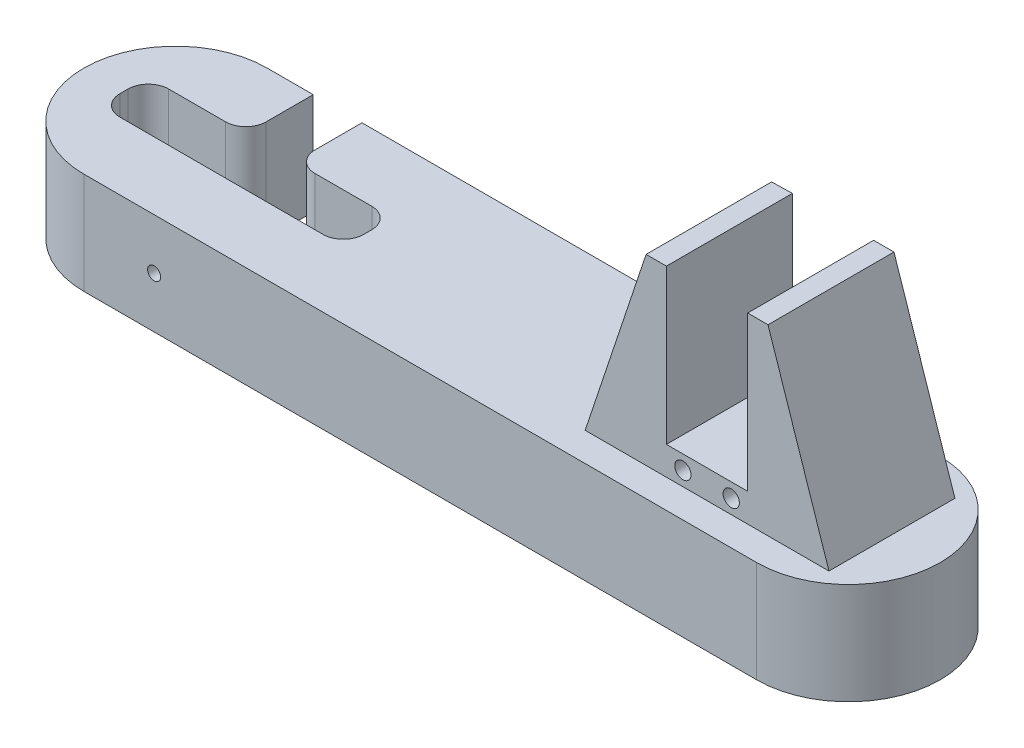
ISO-10303-21;
HEADER;
FILE_DESCRIPTION(('STEP AP214'),'2;1');
FILE_NAME('part.step','',(''),(''),'','','');
FILE_SCHEMA(('AUTOMOTIVE_DESIGN { 1 0 10303 214 1 1 1 1 }'));
ENDSEC;
DATA;
#1=APPLICATION_CONTEXT('core data for automotive mechanical design processes');
#2=APPLICATION_PROTOCOL_DEFINITION('international standard','automotive_design',2000,#1);
#3=PRODUCT_CONTEXT('',#1,'mechanical');
#4=PRODUCT('Part','Part','',(#3));
#5=PRODUCT_RELATED_PRODUCT_CATEGORY('part','',(#4));
#6=PRODUCT_DEFINITION_FORMATION('','',#4);
#7=PRODUCT_DEFINITION_CONTEXT('part definition',#1,'design');
#8=PRODUCT_DEFINITION('design','',#6,#7);
#9=PRODUCT_DEFINITION_SHAPE('','',#8);
#10=(LENGTH_UNIT() NAMED_UNIT(*) SI_UNIT(.MILLI.,.METRE.));
#11=(NAMED_UNIT(*) PLANE_ANGLE_UNIT() SI_UNIT($,.RADIAN.));
#12=(NAMED_UNIT(*) SI_UNIT($,.STERADIAN.) SOLID_ANGLE_UNIT());
#13=UNCERTAINTY_MEASURE_WITH_UNIT(LENGTH_MEASURE(1.E-05),#10,'distance_accuracy_value','');
#14=(GEOMETRIC_REPRESENTATION_CONTEXT(3) GLOBAL_UNCERTAINTY_ASSIGNED_CONTEXT((#13)) GLOBAL_UNIT_ASSIGNED_CONTEXT((#10,
#11,#12)) REPRESENTATION_CONTEXT('',''));
#15=CARTESIAN_POINT('',(0.,0.,0.));
#16=DIRECTION('',(0.,0.,1.));
#17=DIRECTION('',(1.,0.,0.));
#18=AXIS2_PLACEMENT_3D('',#15,#16,#17);
#19=CARTESIAN_POINT('',(-17.3110584301061,-155.276417548068,29.9201970855008));
#20=DIRECTION('',(0.,0.,-1.));
#21=DIRECTION('',(-1.,0.,0.));
#22=AXIS2_PLACEMENT_3D('',#19,#20,#21);
#23=PLANE('',#22);
#24=DIRECTION('',(-1.,0.,0.));
#25=VECTOR('',#24,1.);
#26=CARTESIAN_POINT('',(-17.3110584301061,-130.276417548068,29.9201970855008));
#27=LINE('',#26,#25);
#28=CARTESIAN_POINT('',(-6.,-130.276417548068,29.9201970855008));
#29=VERTEX_POINT('',#28);
#30=CARTESIAN_POINT('',(-17.3110584301061,-130.276417548068,29.9201970855008));
#31=VERTEX_POINT('',#30);
#32=EDGE_CURVE('E267',#29,#31,#27,.T.);
#33=ORIENTED_EDGE('',*,*,#32,.F.);
#34=DIRECTION('',(0.,1.,0.));
#35=VECTOR('',#34,1.);
#36=CARTESIAN_POINT('',(-6.,-155.276417548068,29.9201970855008));
#37=LINE('',#36,#35);
#38=CARTESIAN_POINT('',(-6.,-155.276417548068,29.9201970855008));
#39=VERTEX_POINT('',#38);
#40=EDGE_CURVE('E254',#39,#29,#37,.T.);
#41=ORIENTED_EDGE('',*,*,#40,.F.);
#42=DIRECTION('',(-1.,0.,0.));
#43=VECTOR('',#42,1.);
#44=CARTESIAN_POINT('',(-17.3110584301061,-155.276417548068,29.9201970855008));
#45=LINE('',#44,#43);
#46=CARTESIAN_POINT('',(-17.3110584301061,-155.276417548068,29.9201970855008));
#47=VERTEX_POINT('',#46);
#48=EDGE_CURVE('E265',#39,#47,#45,.T.);
#49=ORIENTED_EDGE('',*,*,#48,.T.);
#50=DIRECTION('',(0.,1.,0.));
#51=VECTOR('',#50,1.);
#52=CARTESIAN_POINT('',(-17.3110584301061,-155.276417548068,29.9201970855008));
#53=LINE('',#52,#51);
#54=EDGE_CURVE('E296',#47,#31,#53,.T.);
#55=ORIENTED_EDGE('',*,*,#54,.T.);
#56=EDGE_LOOP('',(#33,#41,#49,#55));
#57=FACE_BOUND('',#56,.T.);
#58=ADVANCED_FACE('F65',(#57),#23,.T.);
#59=CARTESIAN_POINT('',(148.306843949701,-155.276417548068,29.9201970855008));
#60=VERTEX_POINT('',#59);
#61=CARTESIAN_POINT('',(6.,-155.276417548068,29.9201970855008));
#62=VERTEX_POINT('',#61);
#63=EDGE_CURVE('E275',#60,#62,#45,.T.);
#64=ORIENTED_EDGE('',*,*,#63,.T.);
#65=DIRECTION('',(0.,1.,0.));
#66=VECTOR('',#65,1.);
#67=CARTESIAN_POINT('',(6.,-155.276417548068,29.9201970855008));
#68=LINE('',#67,#66);
#69=CARTESIAN_POINT('',(6.,-130.276417548068,29.9201970855008));
#70=VERTEX_POINT('',#69);
#71=EDGE_CURVE('E269',#62,#70,#68,.T.);
#72=ORIENTED_EDGE('',*,*,#71,.T.);
#73=CARTESIAN_POINT('',(148.306843949701,-130.276417548068,29.9201970855008));
#74=VERTEX_POINT('',#73);
#75=EDGE_CURVE('E293',#74,#70,#27,.T.);
#76=ORIENTED_EDGE('',*,*,#75,.F.);
#77=DIRECTION('',(0.,1.,0.));
#78=VECTOR('',#77,1.);
#79=CARTESIAN_POINT('',(148.306843949701,-155.276417548068,29.9201970855008));
#80=LINE('',#79,#78);
#81=EDGE_CURVE('E299',#60,#74,#80,.T.);
#82=ORIENTED_EDGE('',*,*,#81,.F.);
#83=EDGE_LOOP('',(#64,#72,#76,#82));
#84=FACE_BOUND('',#83,.T.);
#85=ADVANCED_FACE('F515',(#84),#23,.T.);
#86=CARTESIAN_POINT('',(0.,-130.276417548068,0.));
#87=DIRECTION('',(0.,-1.,0.));
#88=DIRECTION('',(0.,0.,-1.));
#89=AXIS2_PLACEMENT_3D('',#86,#87,#88);
#90=PLANE('',#89);
#91=DIRECTION('',(0.,0.,1.));
#92=VECTOR('',#91,1.);
#93=CARTESIAN_POINT('',(114.,-130.276417548068,37.));
#94=LINE('',#93,#92);
#95=CARTESIAN_POINT('',(114.,-130.276417548068,37.));
#96=VERTEX_POINT('',#95);
#97=CARTESIAN_POINT('',(114.,-130.276417548068,37.1297250662334));
#98=VERTEX_POINT('',#97);
#99=EDGE_CURVE('E338',#96,#98,#94,.T.);
#100=ORIENTED_EDGE('',*,*,#99,.T.);
#101=DIRECTION('',(0.999663597969475,0.,-0.0259362852915358));
#102=VECTOR('',#101,1.);
#103=CARTESIAN_POINT('',(114.,-130.276417548068,37.1297250662334));
#104=LINE('',#103,#102);
#105=CARTESIAN_POINT('',(119.,-130.276417548068,37.));
#106=VERTEX_POINT('',#105);
#107=EDGE_CURVE('E365',#98,#106,#104,.T.);
#108=ORIENTED_EDGE('',*,*,#107,.T.);
#109=DIRECTION('',(1.,0.,0.));
#110=VECTOR('',#109,1.);
#111=CARTESIAN_POINT('',(0.,-130.276417548068,37.));
#112=LINE('',#111,#110);
#113=CARTESIAN_POINT('',(159.,-130.276417548068,37.));
#114=VERTEX_POINT('',#113);
#115=EDGE_CURVE('E392',#106,#114,#112,.T.);
#116=ORIENTED_EDGE('',*,*,#115,.T.);
#117=DIRECTION('',(0.,0.,1.));
#118=VECTOR('',#117,1.);
#119=CARTESIAN_POINT('',(159.,-130.276417548068,37.));
#120=LINE('',#119,#118);
#121=CARTESIAN_POINT('',(159.,-130.276417548068,68.));
#122=VERTEX_POINT('',#121);
#123=EDGE_CURVE('E345',#114,#122,#120,.T.);
#124=ORIENTED_EDGE('',*,*,#123,.T.);
#125=DIRECTION('',(1.,0.,0.));
#126=VECTOR('',#125,1.);
#127=CARTESIAN_POINT('',(0.,-130.276417548068,68.));
#128=LINE('',#127,#126);
#129=CARTESIAN_POINT('',(99.,-130.276417548068,68.));
#130=VERTEX_POINT('',#129);
#131=EDGE_CURVE('E383',#130,#122,#128,.T.);
#132=ORIENTED_EDGE('',*,*,#131,.F.);
#133=DIRECTION('',(0.,0.,1.));
#134=VECTOR('',#133,1.);
#135=CARTESIAN_POINT('',(99.,-130.276417548068,37.));
#136=LINE('',#135,#134);
#137=CARTESIAN_POINT('',(99.,-130.276417548068,37.));
#138=VERTEX_POINT('',#137);
#139=EDGE_CURVE('E331',#138,#130,#136,.T.);
#140=ORIENTED_EDGE('',*,*,#139,.F.);
#141=DIRECTION('',(1.,0.,0.));
#142=VECTOR('',#141,1.);
#143=CARTESIAN_POINT('',(0.,-130.276417548068,37.));
#144=LINE('',#143,#142);
#145=EDGE_CURVE('E326',#138,#96,#144,.T.);
#146=ORIENTED_EDGE('',*,*,#145,.T.);
#147=EDGE_LOOP('',(#100,#108,#116,#124,#132,#140,#146));
#148=FACE_BOUND('',#147,.T.);
#149=DIRECTION('',(1.,0.,0.));
#150=VECTOR('',#149,1.);
#151=CARTESIAN_POINT('',(0.,-130.276417548068,46.5));
#152=LINE('',#151,#150);
#153=CARTESIAN_POINT('',(-25.,-130.276417548068,46.5));
#154=VERTEX_POINT('',#153);
#155=CARTESIAN_POINT('',(-11.,-130.276417548068,46.5));
#156=VERTEX_POINT('',#155);
#157=EDGE_CURVE('E476',#154,#156,#152,.T.);
#158=ORIENTED_EDGE('',*,*,#157,.T.);
#159=CARTESIAN_POINT('',(-11.,-130.276417548068,41.5));
#160=DIRECTION('',(0.,-1.,0.));
#161=DIRECTION('',(0.,0.,-1.));
#162=AXIS2_PLACEMENT_3D('',#159,#160,#161);
#163=CIRCLE('',#162,5.);
#164=CARTESIAN_POINT('',(-6.,-130.276417548068,41.5));
#165=VERTEX_POINT('',#164);
#166=EDGE_CURVE('E423',#156,#165,#163,.F.);
#167=ORIENTED_EDGE('',*,*,#166,.T.);
#168=DIRECTION('',(0.,0.,-1.));
#169=VECTOR('',#168,1.);
#170=CARTESIAN_POINT('',(-6.,-130.276417548068,0.));
#171=LINE('',#170,#169);
#172=EDGE_CURVE('E308',#165,#29,#171,.T.);
#173=ORIENTED_EDGE('',*,*,#172,.T.);
#174=ORIENTED_EDGE('',*,*,#32,.T.);
#175=CARTESIAN_POINT('',(-17.3110584301061,-130.276417548068,52.5));
#176=DIRECTION('',(0.,1.,0.));
#177=DIRECTION('',(0.,0.,1.));
#178=AXIS2_PLACEMENT_3D('',#175,#176,#177);
#179=CIRCLE('',#178,22.5798029144992);
#180=CARTESIAN_POINT('',(-17.3110584301061,-130.276417548068,75.0798029144992));
#181=VERTEX_POINT('',#180);
#182=EDGE_CURVE('E268',#31,#181,#179,.T.);
#183=ORIENTED_EDGE('',*,*,#182,.T.);
#184=DIRECTION('',(1.,0.,0.));
#185=VECTOR('',#184,1.);
#186=CARTESIAN_POINT('',(-17.3110584301061,-130.276417548068,75.0798029144992));
#187=LINE('',#186,#185);
#188=CARTESIAN_POINT('',(148.306843949701,-130.276417548068,75.0798029144992));
#189=VERTEX_POINT('',#188);
#190=EDGE_CURVE('E287',#181,#189,#187,.T.);
#191=ORIENTED_EDGE('',*,*,#190,.T.);
#192=CARTESIAN_POINT('',(148.306843949701,-130.276417548068,52.5));
#193=DIRECTION('',(0.,1.,0.));
#194=DIRECTION('',(0.,0.,1.));
#195=AXIS2_PLACEMENT_3D('',#192,#193,#194);
#196=CIRCLE('',#195,22.5798029144992);
#197=EDGE_CURVE('E290',#189,#74,#196,.T.);
#198=ORIENTED_EDGE('',*,*,#197,.T.);
#199=ORIENTED_EDGE('',*,*,#75,.T.);
#200=DIRECTION('',(0.,0.,-1.));
#201=VECTOR('',#200,1.);
#202=CARTESIAN_POINT('',(6.,-130.276417548068,0.));
#203=LINE('',#202,#201);
#204=CARTESIAN_POINT('',(6.,-130.276417548068,41.5));
#205=VERTEX_POINT('',#204);
#206=EDGE_CURVE('E306',#205,#70,#203,.T.);
#207=ORIENTED_EDGE('',*,*,#206,.F.);
#208=CARTESIAN_POINT('',(11.,-130.276417548068,41.5));
#209=DIRECTION('',(0.,-1.,0.));
#210=DIRECTION('',(0.,0.,-1.));
#211=AXIS2_PLACEMENT_3D('',#208,#209,#210);
#212=CIRCLE('',#211,5.);
#213=CARTESIAN_POINT('',(11.,-130.276417548068,46.5));
#214=VERTEX_POINT('',#213);
#215=EDGE_CURVE('E421',#205,#214,#212,.F.);
#216=ORIENTED_EDGE('',*,*,#215,.T.);
#217=DIRECTION('',(1.,0.,0.));
#218=VECTOR('',#217,1.);
#219=CARTESIAN_POINT('',(0.,-130.276417548068,46.5));
#220=LINE('',#219,#218);
#221=CARTESIAN_POINT('',(25.,-130.276417548068,46.5));
#222=VERTEX_POINT('',#221);
#223=EDGE_CURVE('E461',#214,#222,#220,.T.);
#224=ORIENTED_EDGE('',*,*,#223,.T.);
#225=CARTESIAN_POINT('',(25.,-130.276417548068,51.5));
#226=DIRECTION('',(0.,-1.,0.));
#227=DIRECTION('',(0.,0.,-1.));
#228=AXIS2_PLACEMENT_3D('',#225,#226,#227);
#229=CIRCLE('',#228,5.);
#230=CARTESIAN_POINT('',(30.,-130.276417548068,51.5));
#231=VERTEX_POINT('',#230);
#232=EDGE_CURVE('E73',#222,#231,#229,.T.);
#233=ORIENTED_EDGE('',*,*,#232,.T.);
#234=DIRECTION('',(0.,0.,1.));
#235=VECTOR('',#234,1.);
#236=CARTESIAN_POINT('',(30.,-130.276417548068,0.));
#237=LINE('',#236,#235);
#238=CARTESIAN_POINT('',(30.,-130.276417548068,53.5));
#239=VERTEX_POINT('',#238);
#240=EDGE_CURVE('E459',#231,#239,#237,.T.);
#241=ORIENTED_EDGE('',*,*,#240,.T.);
#242=CARTESIAN_POINT('',(25.,-130.276417548068,53.5));
#243=DIRECTION('',(0.,-1.,0.));
#244=DIRECTION('',(0.,0.,-1.));
#245=AXIS2_PLACEMENT_3D('',#242,#243,#244);
#246=CIRCLE('',#245,5.);
#247=CARTESIAN_POINT('',(25.,-130.276417548068,58.5));
#248=VERTEX_POINT('',#247);
#249=EDGE_CURVE('E410',#239,#248,#246,.T.);
#250=ORIENTED_EDGE('',*,*,#249,.T.);
#251=DIRECTION('',(1.,0.,0.));
#252=VECTOR('',#251,1.);
#253=CARTESIAN_POINT('',(0.,-130.276417548068,58.5));
#254=LINE('',#253,#252);
#255=CARTESIAN_POINT('',(-25.,-130.276417548068,58.5));
#256=VERTEX_POINT('',#255);
#257=EDGE_CURVE('E298',#256,#248,#254,.T.);
#258=ORIENTED_EDGE('',*,*,#257,.F.);
#259=CARTESIAN_POINT('',(-25.,-130.276417548068,53.5));
#260=DIRECTION('',(0.,-1.,0.));
#261=DIRECTION('',(0.,0.,-1.));
#262=AXIS2_PLACEMENT_3D('',#259,#260,#261);
#263=CIRCLE('',#262,5.);
#264=CARTESIAN_POINT('',(-30.,-130.276417548068,53.5));
#265=VERTEX_POINT('',#264);
#266=EDGE_CURVE('E447',#256,#265,#263,.T.);
#267=ORIENTED_EDGE('',*,*,#266,.T.);
#268=DIRECTION('',(0.,0.,-1.));
#269=VECTOR('',#268,1.);
#270=CARTESIAN_POINT('',(-30.,-130.276417548068,0.));
#271=LINE('',#270,#269);
#272=CARTESIAN_POINT('',(-30.,-130.276417548068,51.5));
#273=VERTEX_POINT('',#272);
#274=EDGE_CURVE('E468',#265,#273,#271,.T.);
#275=ORIENTED_EDGE('',*,*,#274,.T.);
#276=CARTESIAN_POINT('',(-25.,-130.276417548068,51.5));
#277=DIRECTION('',(0.,-1.,0.));
#278=DIRECTION('',(0.,0.,-1.));
#279=AXIS2_PLACEMENT_3D('',#276,#277,#278);
#280=CIRCLE('',#279,5.);
#281=EDGE_CURVE('E451',#273,#154,#280,.T.);
#282=ORIENTED_EDGE('',*,*,#281,.T.);
#283=EDGE_LOOP('',(#158,#167,#173,#174,#183,#191,#198,#199,#207,#216,#224,#233,#241,#250,#258,
#267,#275,#282));
#284=FACE_BOUND('',#283,.T.);
#285=ADVANCED_FACE('F458',(#148,#284),#90,.F.);
#286=CARTESIAN_POINT('',(0.,-123.276417548068,68.));
#287=DIRECTION('',(0.,0.,-1.));
#288=DIRECTION('',(-1.,0.,0.));
#289=AXIS2_PLACEMENT_3D('',#286,#287,#288);
#290=PLANE('',#289);
#291=CARTESIAN_POINT('',(134.95,-126.776417548068,68.));
#292=DIRECTION('',(0.,0.,-1.));
#293=DIRECTION('',(-1.,0.,0.));
#294=AXIS2_PLACEMENT_3D('',#291,#292,#293);
#295=CIRCLE('',#294,2.);
#296=CARTESIAN_POINT('',(132.95,-126.776417548068,68.));
#297=VERTEX_POINT('',#296);
#298=EDGE_CURVE('E319',#297,#297,#295,.T.);
#299=ORIENTED_EDGE('',*,*,#298,.T.);
#300=EDGE_LOOP('',(#299));
#301=FACE_BOUND('',#300,.T.);
#302=CARTESIAN_POINT('',(123.05,-126.776417548068,68.));
#303=DIRECTION('',(0.,0.,-1.));
#304=DIRECTION('',(-1.,0.,0.));
#305=AXIS2_PLACEMENT_3D('',#302,#303,#304);
#306=CIRCLE('',#305,2.);
#307=CARTESIAN_POINT('',(121.05,-126.776417548068,68.));
#308=VERTEX_POINT('',#307);
#309=EDGE_CURVE('E314',#308,#308,#306,.T.);
#310=ORIENTED_EDGE('',*,*,#309,.T.);
#311=EDGE_LOOP('',(#310));
#312=FACE_BOUND('',#311,.T.);
#313=ORIENTED_EDGE('',*,*,#131,.T.);
#314=DIRECTION('',(0.316227766016838,-0.948683298050514,0.));
#315=VECTOR('',#314,1.);
#316=CARTESIAN_POINT('',(104.01707473558,34.6723582451933,68.));
#317=LINE('',#316,#315);
#318=CARTESIAN_POINT('',(144.,-85.2764175480678,68.));
#319=VERTEX_POINT('',#318);
#320=EDGE_CURVE('E337',#319,#122,#317,.T.);
#321=ORIENTED_EDGE('',*,*,#320,.F.);
#322=DIRECTION('',(1.,0.,0.));
#323=VECTOR('',#322,1.);
#324=CARTESIAN_POINT('',(139.,-85.2764175480678,68.));
#325=LINE('',#324,#323);
#326=CARTESIAN_POINT('',(139.,-85.2764175480678,68.));
#327=VERTEX_POINT('',#326);
#328=EDGE_CURVE('E355',#327,#319,#325,.T.);
#329=ORIENTED_EDGE('',*,*,#328,.F.);
#330=DIRECTION('',(0.,-1.,0.));
#331=VECTOR('',#330,1.);
#332=CARTESIAN_POINT('',(139.,-85.2764175480678,68.));
#333=LINE('',#332,#331);
#334=CARTESIAN_POINT('',(139.,-123.276417548068,68.));
#335=VERTEX_POINT('',#334);
#336=EDGE_CURVE('E352',#327,#335,#333,.T.);
#337=ORIENTED_EDGE('',*,*,#336,.T.);
#338=DIRECTION('',(1.,0.,0.));
#339=VECTOR('',#338,1.);
#340=CARTESIAN_POINT('',(0.,-123.276417548068,68.));
#341=LINE('',#340,#339);
#342=CARTESIAN_POINT('',(119.,-123.276417548068,68.));
#343=VERTEX_POINT('',#342);
#344=EDGE_CURVE('E388',#343,#335,#341,.T.);
#345=ORIENTED_EDGE('',*,*,#344,.F.);
#346=DIRECTION('',(0.,-1.,0.));
#347=VECTOR('',#346,1.);
#348=CARTESIAN_POINT('',(119.,-85.2764175480678,68.));
#349=LINE('',#348,#347);
#350=CARTESIAN_POINT('',(119.,-85.2764175480678,68.));
#351=VERTEX_POINT('',#350);
#352=EDGE_CURVE('E384',#351,#343,#349,.T.);
#353=ORIENTED_EDGE('',*,*,#352,.F.);
#354=DIRECTION('',(-1.,0.,0.));
#355=VECTOR('',#354,1.);
#356=CARTESIAN_POINT('',(119.,-85.2764175480678,68.));
#357=LINE('',#356,#355);
#358=CARTESIAN_POINT('',(114.,-85.2764175480678,68.));
#359=VERTEX_POINT('',#358);
#360=EDGE_CURVE('E372',#351,#359,#357,.T.);
#361=ORIENTED_EDGE('',*,*,#360,.T.);
#362=DIRECTION('',(-0.316227766016838,-0.948683298050514,0.));
#363=VECTOR('',#362,1.);
#364=CARTESIAN_POINT('',(128.18292526442,-42.7276417548068,68.));
#365=LINE('',#364,#363);
#366=EDGE_CURVE('E322',#359,#130,#365,.T.);
#367=ORIENTED_EDGE('',*,*,#366,.T.);
#368=EDGE_LOOP('',(#313,#321,#329,#337,#345,#353,#361,#367));
#369=FACE_BOUND('',#368,.T.);
#370=ADVANCED_FACE('F708',(#301,#312,#369),#290,.F.);
#371=CARTESIAN_POINT('',(0.,-123.276417548068,37.));
#372=DIRECTION('',(0.,0.,-1.));
#373=DIRECTION('',(-1.,0.,0.));
#374=AXIS2_PLACEMENT_3D('',#371,#372,#373);
#375=PLANE('',#374);
#376=CARTESIAN_POINT('',(134.95,-126.776417548068,37.));
#377=DIRECTION('',(0.,0.,-1.));
#378=DIRECTION('',(-1.,0.,0.));
#379=AXIS2_PLACEMENT_3D('',#376,#377,#378);
#380=CIRCLE('',#379,2.);
#381=CARTESIAN_POINT('',(132.95,-126.776417548068,37.));
#382=VERTEX_POINT('',#381);
#383=EDGE_CURVE('E311',#382,#382,#380,.T.);
#384=ORIENTED_EDGE('',*,*,#383,.F.);
#385=EDGE_LOOP('',(#384));
#386=FACE_BOUND('',#385,.T.);
#387=CARTESIAN_POINT('',(123.05,-126.776417548068,37.));
#388=DIRECTION('',(0.,0.,-1.));
#389=DIRECTION('',(-1.,0.,0.));
#390=AXIS2_PLACEMENT_3D('',#387,#388,#389);
#391=CIRCLE('',#390,2.);
#392=CARTESIAN_POINT('',(121.05,-126.776417548068,37.));
#393=VERTEX_POINT('',#392);
#394=EDGE_CURVE('E310',#393,#393,#391,.T.);
#395=ORIENTED_EDGE('',*,*,#394,.F.);
#396=EDGE_LOOP('',(#395));
#397=FACE_BOUND('',#396,.T.);
#398=ORIENTED_EDGE('',*,*,#115,.F.);
#399=DIRECTION('',(0.,-1.,0.));
#400=VECTOR('',#399,1.);
#401=CARTESIAN_POINT('',(119.,-123.276417548068,37.));
#402=LINE('',#401,#400);
#403=CARTESIAN_POINT('',(119.,-123.276417548068,37.));
#404=VERTEX_POINT('',#403);
#405=EDGE_CURVE('E401',#404,#106,#402,.T.);
#406=ORIENTED_EDGE('',*,*,#405,.F.);
#407=DIRECTION('',(1.,0.,0.));
#408=VECTOR('',#407,1.);
#409=CARTESIAN_POINT('',(0.,-123.276417548068,37.));
#410=LINE('',#409,#408);
#411=CARTESIAN_POINT('',(139.,-123.276417548068,37.));
#412=VERTEX_POINT('',#411);
#413=EDGE_CURVE('E395',#404,#412,#410,.T.);
#414=ORIENTED_EDGE('',*,*,#413,.T.);
#415=DIRECTION('',(0.,-1.,0.));
#416=VECTOR('',#415,1.);
#417=CARTESIAN_POINT('',(139.,-85.2764175480678,37.));
#418=LINE('',#417,#416);
#419=CARTESIAN_POINT('',(139.,-85.2764175480678,37.));
#420=VERTEX_POINT('',#419);
#421=EDGE_CURVE('E350',#420,#412,#418,.T.);
#422=ORIENTED_EDGE('',*,*,#421,.F.);
#423=DIRECTION('',(-1.,0.,0.));
#424=VECTOR('',#423,1.);
#425=CARTESIAN_POINT('',(144.,-85.2764175480678,37.));
#426=LINE('',#425,#424);
#427=CARTESIAN_POINT('',(144.,-85.2764175480678,37.));
#428=VERTEX_POINT('',#427);
#429=EDGE_CURVE('E360',#428,#420,#426,.T.);
#430=ORIENTED_EDGE('',*,*,#429,.F.);
#431=DIRECTION('',(0.316227766016838,-0.948683298050514,0.));
#432=VECTOR('',#431,1.);
#433=CARTESIAN_POINT('',(104.01707473558,34.6723582451933,37.));
#434=LINE('',#433,#432);
#435=EDGE_CURVE('E342',#428,#114,#434,.T.);
#436=ORIENTED_EDGE('',*,*,#435,.T.);
#437=EDGE_LOOP('',(#398,#406,#414,#422,#430,#436));
#438=FACE_BOUND('',#437,.T.);
#439=ADVANCED_FACE('F798',(#386,#397,#438),#375,.T.);
#440=CARTESIAN_POINT('',(0.,-123.276417548068,0.));
#441=DIRECTION('',(0.,1.,0.));
#442=DIRECTION('',(0.,0.,1.));
#443=AXIS2_PLACEMENT_3D('',#440,#441,#442);
#444=PLANE('',#443);
#445=ORIENTED_EDGE('',*,*,#344,.T.);
#446=DIRECTION('',(0.,0.,-1.));
#447=VECTOR('',#446,1.);
#448=CARTESIAN_POINT('',(139.,-123.276417548068,0.));
#449=LINE('',#448,#447);
#450=EDGE_CURVE('E391',#335,#412,#449,.T.);
#451=ORIENTED_EDGE('',*,*,#450,.T.);
#452=ORIENTED_EDGE('',*,*,#413,.F.);
#453=DIRECTION('',(0.,0.,1.));
#454=VECTOR('',#453,1.);
#455=CARTESIAN_POINT('',(119.,-123.276417548068,0.));
#456=LINE('',#455,#454);
#457=EDGE_CURVE('E398',#404,#343,#456,.T.);
#458=ORIENTED_EDGE('',*,*,#457,.T.);
#459=EDGE_LOOP('',(#445,#451,#452,#458));
#460=FACE_BOUND('',#459,.T.);
#461=ADVANCED_FACE('F803',(#460),#444,.T.);
#462=CARTESIAN_POINT('',(114.,-85.2764175480678,37.1297250662334));
#463=DIRECTION('',(-0.0259362852915358,0.,-0.999663597969475));
#464=DIRECTION('',(-0.999663597969475,0.,0.0259362852915358));
#465=AXIS2_PLACEMENT_3D('',#462,#463,#464);
#466=PLANE('',#465);
#467=ORIENTED_EDGE('',*,*,#107,.F.);
#468=DIRECTION('',(0.,-1.,0.));
#469=VECTOR('',#468,1.);
#470=CARTESIAN_POINT('',(114.,-85.2764175480678,37.1297250662334));
#471=LINE('',#470,#469);
#472=CARTESIAN_POINT('',(114.,-85.2764175480678,37.1297250662334));
#473=VERTEX_POINT('',#472);
#474=EDGE_CURVE('E380',#473,#98,#471,.T.);
#475=ORIENTED_EDGE('',*,*,#474,.F.);
#476=DIRECTION('',(0.999663597969475,0.,-0.0259362852915358));
#477=VECTOR('',#476,1.);
#478=CARTESIAN_POINT('',(114.,-85.2764175480678,37.1297250662334));
#479=LINE('',#478,#477);
#480=CARTESIAN_POINT('',(119.,-85.2764175480678,37.));
#481=VERTEX_POINT('',#480);
#482=EDGE_CURVE('E366',#473,#481,#479,.T.);
#483=ORIENTED_EDGE('',*,*,#482,.T.);
#484=DIRECTION('',(0.,-1.,0.));
#485=VECTOR('',#484,1.);
#486=CARTESIAN_POINT('',(119.,-85.2764175480678,37.));
#487=LINE('',#486,#485);
#488=EDGE_CURVE('E377',#481,#404,#487,.T.);
#489=ORIENTED_EDGE('',*,*,#488,.T.);
#490=ORIENTED_EDGE('',*,*,#405,.T.);
#491=EDGE_LOOP('',(#467,#475,#483,#489,#490));
#492=FACE_BOUND('',#491,.T.);
#493=ADVANCED_FACE('F889',(#492),#466,.T.);
#494=CARTESIAN_POINT('',(119.,-85.2764175480678,37.));
#495=DIRECTION('',(1.,0.,0.));
#496=DIRECTION('',(0.,0.,-1.));
#497=AXIS2_PLACEMENT_3D('',#494,#495,#496);
#498=PLANE('',#497);
#499=ORIENTED_EDGE('',*,*,#352,.T.);
#500=ORIENTED_EDGE('',*,*,#457,.F.);
#501=ORIENTED_EDGE('',*,*,#488,.F.);
#502=DIRECTION('',(0.,0.,1.));
#503=VECTOR('',#502,1.);
#504=CARTESIAN_POINT('',(119.,-85.2764175480678,37.));
#505=LINE('',#504,#503);
#506=EDGE_CURVE('E369',#481,#351,#505,.T.);
#507=ORIENTED_EDGE('',*,*,#506,.T.);
#508=EDGE_LOOP('',(#499,#500,#501,#507));
#509=FACE_BOUND('',#508,.T.);
#510=ADVANCED_FACE('F880',(#509),#498,.T.);
#511=CARTESIAN_POINT('',(0.,-85.2764175480678,0.));
#512=DIRECTION('',(0.,-1.,0.));
#513=DIRECTION('',(0.,0.,-1.));
#514=AXIS2_PLACEMENT_3D('',#511,#512,#513);
#515=PLANE('',#514);
#516=ORIENTED_EDGE('',*,*,#482,.F.);
#517=DIRECTION('',(0.,0.,-1.));
#518=VECTOR('',#517,1.);
#519=CARTESIAN_POINT('',(114.,-85.2764175480678,68.));
#520=LINE('',#519,#518);
#521=EDGE_CURVE('E374',#359,#473,#520,.T.);
#522=ORIENTED_EDGE('',*,*,#521,.F.);
#523=ORIENTED_EDGE('',*,*,#360,.F.);
#524=ORIENTED_EDGE('',*,*,#506,.F.);
#525=EDGE_LOOP('',(#516,#522,#523,#524));
#526=FACE_BOUND('',#525,.T.);
#527=ADVANCED_FACE('F875',(#526),#515,.F.);
#528=CARTESIAN_POINT('',(139.,-85.2764175480678,37.));
#529=DIRECTION('',(1.,0.,0.));
#530=DIRECTION('',(0.,0.,-1.));
#531=AXIS2_PLACEMENT_3D('',#528,#529,#530);
#532=PLANE('',#531);
#533=ORIENTED_EDGE('',*,*,#450,.F.);
#534=ORIENTED_EDGE('',*,*,#336,.F.);
#535=DIRECTION('',(0.,0.,1.));
#536=VECTOR('',#535,1.);
#537=CARTESIAN_POINT('',(139.,-85.2764175480678,37.));
#538=LINE('',#537,#536);
#539=EDGE_CURVE('E358',#420,#327,#538,.T.);
#540=ORIENTED_EDGE('',*,*,#539,.F.);
#541=ORIENTED_EDGE('',*,*,#421,.T.);
#542=EDGE_LOOP('',(#533,#534,#540,#541));
#543=FACE_BOUND('',#542,.T.);
#544=ADVANCED_FACE('F866',(#543),#532,.F.);
#545=CARTESIAN_POINT('',(0.,-85.2764175480678,0.));
#546=DIRECTION('',(0.,1.,0.));
#547=DIRECTION('',(0.,0.,1.));
#548=AXIS2_PLACEMENT_3D('',#545,#546,#547);
#549=PLANE('',#548);
#550=DIRECTION('',(0.,0.,-1.));
#551=VECTOR('',#550,1.);
#552=CARTESIAN_POINT('',(144.,-85.2764175480678,68.));
#553=LINE('',#552,#551);
#554=EDGE_CURVE('E362',#319,#428,#553,.T.);
#555=ORIENTED_EDGE('',*,*,#554,.T.);
#556=ORIENTED_EDGE('',*,*,#429,.T.);
#557=ORIENTED_EDGE('',*,*,#539,.T.);
#558=ORIENTED_EDGE('',*,*,#328,.T.);
#559=EDGE_LOOP('',(#555,#556,#557,#558));
#560=FACE_BOUND('',#559,.T.);
#561=ADVANCED_FACE('F855',(#560),#549,.T.);
#562=CARTESIAN_POINT('',(104.01707473558,34.6723582451933,37.));
#563=DIRECTION('',(-0.948683298050514,-0.316227766016838,0.));
#564=DIRECTION('',(0.316227766016838,-0.948683298050514,0.));
#565=AXIS2_PLACEMENT_3D('',#562,#563,#564);
#566=PLANE('',#565);
#567=ORIENTED_EDGE('',*,*,#320,.T.);
#568=ORIENTED_EDGE('',*,*,#123,.F.);
#569=ORIENTED_EDGE('',*,*,#435,.F.);
#570=ORIENTED_EDGE('',*,*,#554,.F.);
#571=EDGE_LOOP('',(#567,#568,#569,#570));
#572=FACE_BOUND('',#571,.T.);
#573=ADVANCED_FACE('F845',(#572),#566,.F.);
#574=CARTESIAN_POINT('',(128.18292526442,-42.7276417548068,37.));
#575=DIRECTION('',(-0.948683298050514,0.316227766016838,0.));
#576=DIRECTION('',(-0.316227766016838,-0.948683298050514,0.));
#577=AXIS2_PLACEMENT_3D('',#574,#575,#576);
#578=PLANE('',#577);
#579=ORIENTED_EDGE('',*,*,#366,.F.);
#580=ORIENTED_EDGE('',*,*,#521,.T.);
#581=DIRECTION('',(0.,0.,1.));
#582=VECTOR('',#581,1.);
#583=CARTESIAN_POINT('',(114.,-85.2764175480678,37.));
#584=LINE('',#583,#582);
#585=CARTESIAN_POINT('',(114.,-85.2764175480678,37.));
#586=VERTEX_POINT('',#585);
#587=EDGE_CURVE('E334',#586,#473,#584,.T.);
#588=ORIENTED_EDGE('',*,*,#587,.F.);
#589=DIRECTION('',(-0.316227766016838,-0.948683298050514,0.));
#590=VECTOR('',#589,1.);
#591=CARTESIAN_POINT('',(128.18292526442,-42.7276417548068,37.));
#592=LINE('',#591,#590);
#593=EDGE_CURVE('E323',#586,#138,#592,.T.);
#594=ORIENTED_EDGE('',*,*,#593,.T.);
#595=ORIENTED_EDGE('',*,*,#139,.T.);
#596=EDGE_LOOP('',(#579,#580,#588,#594,#595));
#597=FACE_BOUND('',#596,.T.);
#598=ADVANCED_FACE('F834',(#597),#578,.T.);
#599=CARTESIAN_POINT('',(114.,0.,37.));
#600=DIRECTION('',(-1.,0.,0.));
#601=DIRECTION('',(0.,0.,1.));
#602=AXIS2_PLACEMENT_3D('',#599,#600,#601);
#603=PLANE('',#602);
#604=ORIENTED_EDGE('',*,*,#474,.T.);
#605=ORIENTED_EDGE('',*,*,#99,.F.);
#606=DIRECTION('',(0.,-1.,0.));
#607=VECTOR('',#606,1.);
#608=CARTESIAN_POINT('',(114.,0.,37.));
#609=LINE('',#608,#607);
#610=EDGE_CURVE('E328',#586,#96,#609,.T.);
#611=ORIENTED_EDGE('',*,*,#610,.F.);
#612=ORIENTED_EDGE('',*,*,#587,.T.);
#613=EDGE_LOOP('',(#604,#605,#611,#612));
#614=FACE_BOUND('',#613,.T.);
#615=ADVANCED_FACE('F823',(#614),#603,.F.);
#616=CARTESIAN_POINT('',(0.,0.,37.));
#617=DIRECTION('',(0.,0.,1.));
#618=DIRECTION('',(1.,0.,0.));
#619=AXIS2_PLACEMENT_3D('',#616,#617,#618);
#620=PLANE('',#619);
#621=ORIENTED_EDGE('',*,*,#593,.F.);
#622=ORIENTED_EDGE('',*,*,#610,.T.);
#623=ORIENTED_EDGE('',*,*,#145,.F.);
#624=EDGE_LOOP('',(#621,#622,#623));
#625=FACE_BOUND('',#624,.T.);
#626=ADVANCED_FACE('F789',(#625),#620,.F.);
#627=CARTESIAN_POINT('',(123.05,-126.776417548068,96.));
#628=DIRECTION('',(0.,0.,-1.));
#629=DIRECTION('',(-1.,0.,0.));
#630=AXIS2_PLACEMENT_3D('',#627,#628,#629);
#631=CYLINDRICAL_SURFACE('',#630,2.);
#632=ORIENTED_EDGE('',*,*,#394,.T.);
#633=EDGE_LOOP('',(#632));
#634=FACE_BOUND('',#633,.T.);
#635=ORIENTED_EDGE('',*,*,#309,.F.);
#636=EDGE_LOOP('',(#635));
#637=FACE_BOUND('',#636,.T.);
#638=ADVANCED_FACE('F510',(#634,#637),#631,.F.);
#639=CARTESIAN_POINT('',(134.95,-126.776417548068,96.));
#640=DIRECTION('',(0.,0.,-1.));
#641=DIRECTION('',(-1.,0.,0.));
#642=AXIS2_PLACEMENT_3D('',#639,#640,#641);
#643=CYLINDRICAL_SURFACE('',#642,2.);
#644=ORIENTED_EDGE('',*,*,#383,.T.);
#645=EDGE_LOOP('',(#644));
#646=FACE_BOUND('',#645,.T.);
#647=ORIENTED_EDGE('',*,*,#298,.F.);
#648=EDGE_LOOP('',(#647));
#649=FACE_BOUND('',#648,.T.);
#650=ADVANCED_FACE('F503',(#646,#649),#643,.F.);
#651=CARTESIAN_POINT('',(-17.3110584301061,-155.276417548068,52.5));
#652=DIRECTION('',(0.,1.,0.));
#653=DIRECTION('',(0.,0.,1.));
#654=AXIS2_PLACEMENT_3D('',#651,#652,#653);
#655=CYLINDRICAL_SURFACE('',#654,22.5798029144992);
#656=ORIENTED_EDGE('',*,*,#182,.F.);
#657=ORIENTED_EDGE('',*,*,#54,.F.);
#658=CARTESIAN_POINT('',(-17.3110584301061,-155.276417548068,52.5));
#659=DIRECTION('',(0.,1.,0.));
#660=DIRECTION('',(0.,0.,1.));
#661=AXIS2_PLACEMENT_3D('',#658,#659,#660);
#662=CIRCLE('',#661,22.5798029144992);
#663=CARTESIAN_POINT('',(-17.3110584301061,-155.276417548068,75.0798029144992));
#664=VERTEX_POINT('',#663);
#665=EDGE_CURVE('E274',#47,#664,#662,.T.);
#666=ORIENTED_EDGE('',*,*,#665,.T.);
#667=DIRECTION('',(0.,1.,0.));
#668=VECTOR('',#667,1.);
#669=CARTESIAN_POINT('',(-17.3110584301061,-155.276417548068,75.0798029144992));
#670=LINE('',#669,#668);
#671=EDGE_CURVE('E279',#664,#181,#670,.T.);
#672=ORIENTED_EDGE('',*,*,#671,.T.);
#673=EDGE_LOOP('',(#656,#657,#666,#672));
#674=FACE_BOUND('',#673,.T.);
#675=ADVANCED_FACE('F501',(#674),#655,.T.);
#676=CARTESIAN_POINT('',(148.306843949701,-155.276417548068,52.5));
#677=DIRECTION('',(0.,1.,0.));
#678=DIRECTION('',(0.,0.,1.));
#679=AXIS2_PLACEMENT_3D('',#676,#677,#678);
#680=CYLINDRICAL_SURFACE('',#679,22.5798029144992);
#681=ORIENTED_EDGE('',*,*,#197,.F.);
#682=DIRECTION('',(0.,1.,0.));
#683=VECTOR('',#682,1.);
#684=CARTESIAN_POINT('',(148.306843949701,-155.276417548068,75.0798029144992));
#685=LINE('',#684,#683);
#686=CARTESIAN_POINT('',(148.306843949701,-155.276417548068,75.0798029144992));
#687=VERTEX_POINT('',#686);
#688=EDGE_CURVE('E301',#687,#189,#685,.T.);
#689=ORIENTED_EDGE('',*,*,#688,.F.);
#690=CARTESIAN_POINT('',(148.306843949701,-155.276417548068,52.5));
#691=DIRECTION('',(0.,1.,0.));
#692=DIRECTION('',(0.,0.,1.));
#693=AXIS2_PLACEMENT_3D('',#690,#691,#692);
#694=CIRCLE('',#693,22.5798029144992);
#695=EDGE_CURVE('E276',#687,#60,#694,.T.);
#696=ORIENTED_EDGE('',*,*,#695,.T.);
#697=ORIENTED_EDGE('',*,*,#81,.T.);
#698=EDGE_LOOP('',(#681,#689,#696,#697));
#699=FACE_BOUND('',#698,.T.);
#700=ADVANCED_FACE('F496',(#699),#680,.T.);
#701=CARTESIAN_POINT('',(-17.3110584301061,-155.276417548068,75.0798029144992));
#702=DIRECTION('',(0.,0.,1.));
#703=DIRECTION('',(1.,0.,0.));
#704=AXIS2_PLACEMENT_3D('',#701,#702,#703);
#705=PLANE('',#704);
#706=CARTESIAN_POINT('',(0.,-142.776417548068,75.0798029144992));
#707=DIRECTION('',(0.,0.,-1.));
#708=DIRECTION('',(-1.,0.,0.));
#709=AXIS2_PLACEMENT_3D('',#706,#707,#708);
#710=CIRCLE('',#709,1.6);
#711=CARTESIAN_POINT('',(-1.6,-142.776417548068,75.0798029144992));
#712=VERTEX_POINT('',#711);
#713=EDGE_CURVE('E532',#712,#712,#710,.T.);
#714=ORIENTED_EDGE('',*,*,#713,.T.);
#715=EDGE_LOOP('',(#714));
#716=FACE_BOUND('',#715,.T.);
#717=ORIENTED_EDGE('',*,*,#190,.F.);
#718=ORIENTED_EDGE('',*,*,#671,.F.);
#719=DIRECTION('',(1.,0.,0.));
#720=VECTOR('',#719,1.);
#721=CARTESIAN_POINT('',(-17.3110584301061,-155.276417548068,75.0798029144992));
#722=LINE('',#721,#720);
#723=EDGE_CURVE('E281',#664,#687,#722,.T.);
#724=ORIENTED_EDGE('',*,*,#723,.T.);
#725=ORIENTED_EDGE('',*,*,#688,.T.);
#726=EDGE_LOOP('',(#717,#718,#724,#725));
#727=FACE_BOUND('',#726,.T.);
#728=ADVANCED_FACE('F493',(#716,#727),#705,.T.);
#729=CARTESIAN_POINT('',(0.,-155.276417548068,0.));
#730=DIRECTION('',(0.,-1.,0.));
#731=DIRECTION('',(0.,0.,-1.));
#732=AXIS2_PLACEMENT_3D('',#729,#730,#731);
#733=PLANE('',#732);
#734=DIRECTION('',(0.,0.,1.));
#735=VECTOR('',#734,1.);
#736=CARTESIAN_POINT('',(-6.,-155.276417548068,0.));
#737=LINE('',#736,#735);
#738=CARTESIAN_POINT('',(-6.,-155.276417548068,41.5));
#739=VERTEX_POINT('',#738);
#740=EDGE_CURVE('E250',#39,#739,#737,.T.);
#741=ORIENTED_EDGE('',*,*,#740,.T.);
#742=CARTESIAN_POINT('',(-11.,-155.276417548068,41.5));
#743=DIRECTION('',(0.,-1.,0.));
#744=DIRECTION('',(0.,0.,-1.));
#745=AXIS2_PLACEMENT_3D('',#742,#743,#744);
#746=CIRCLE('',#745,5.);
#747=CARTESIAN_POINT('',(-11.,-155.276417548068,46.5));
#748=VERTEX_POINT('',#747);
#749=EDGE_CURVE('E428',#739,#748,#746,.T.);
#750=ORIENTED_EDGE('',*,*,#749,.T.);
#751=DIRECTION('',(1.,0.,0.));
#752=VECTOR('',#751,1.);
#753=CARTESIAN_POINT('',(0.,-155.276417548068,46.5));
#754=LINE('',#753,#752);
#755=CARTESIAN_POINT('',(-25.,-155.276417548068,46.5));
#756=VERTEX_POINT('',#755);
#757=EDGE_CURVE('E260',#756,#748,#754,.T.);
#758=ORIENTED_EDGE('',*,*,#757,.F.);
#759=CARTESIAN_POINT('',(-25.,-155.276417548068,51.5));
#760=DIRECTION('',(0.,-1.,0.));
#761=DIRECTION('',(0.,0.,-1.));
#762=AXIS2_PLACEMENT_3D('',#759,#760,#761);
#763=CIRCLE('',#762,5.);
#764=CARTESIAN_POINT('',(-30.,-155.276417548068,51.5));
#765=VERTEX_POINT('',#764);
#766=EDGE_CURVE('E453',#756,#765,#763,.F.);
#767=ORIENTED_EDGE('',*,*,#766,.T.);
#768=DIRECTION('',(0.,0.,-1.));
#769=VECTOR('',#768,1.);
#770=CARTESIAN_POINT('',(-30.,-155.276417548068,0.));
#771=LINE('',#770,#769);
#772=CARTESIAN_POINT('',(-30.,-155.276417548068,53.5));
#773=VERTEX_POINT('',#772);
#774=EDGE_CURVE('E546',#773,#765,#771,.T.);
#775=ORIENTED_EDGE('',*,*,#774,.F.);
#776=CARTESIAN_POINT('',(-25.,-155.276417548068,53.5));
#777=DIRECTION('',(0.,-1.,0.));
#778=DIRECTION('',(0.,0.,-1.));
#779=AXIS2_PLACEMENT_3D('',#776,#777,#778);
#780=CIRCLE('',#779,5.);
#781=CARTESIAN_POINT('',(-25.,-155.276417548068,58.5));
#782=VERTEX_POINT('',#781);
#783=EDGE_CURVE('E449',#773,#782,#780,.F.);
#784=ORIENTED_EDGE('',*,*,#783,.T.);
#785=DIRECTION('',(-1.,0.,0.));
#786=VECTOR('',#785,1.);
#787=CARTESIAN_POINT('',(0.,-155.276417548068,58.5));
#788=LINE('',#787,#786);
#789=CARTESIAN_POINT('',(25.,-155.276417548068,58.5));
#790=VERTEX_POINT('',#789);
#791=EDGE_CURVE('E478',#790,#782,#788,.T.);
#792=ORIENTED_EDGE('',*,*,#791,.F.);
#793=CARTESIAN_POINT('',(25.,-155.276417548068,53.5));
#794=DIRECTION('',(0.,-1.,0.));
#795=DIRECTION('',(0.,0.,-1.));
#796=AXIS2_PLACEMENT_3D('',#793,#794,#795);
#797=CIRCLE('',#796,5.);
#798=CARTESIAN_POINT('',(30.,-155.276417548068,53.5));
#799=VERTEX_POINT('',#798);
#800=EDGE_CURVE('E413',#790,#799,#797,.F.);
#801=ORIENTED_EDGE('',*,*,#800,.T.);
#802=DIRECTION('',(0.,0.,1.));
#803=VECTOR('',#802,1.);
#804=CARTESIAN_POINT('',(30.,-155.276417548068,0.));
#805=LINE('',#804,#803);
#806=CARTESIAN_POINT('',(30.,-155.276417548068,51.5));
#807=VERTEX_POINT('',#806);
#808=EDGE_CURVE('E474',#807,#799,#805,.T.);
#809=ORIENTED_EDGE('',*,*,#808,.F.);
#810=CARTESIAN_POINT('',(25.,-155.276417548068,51.5));
#811=DIRECTION('',(0.,-1.,0.));
#812=DIRECTION('',(0.,0.,-1.));
#813=AXIS2_PLACEMENT_3D('',#810,#811,#812);
#814=CIRCLE('',#813,5.);
#815=CARTESIAN_POINT('',(25.,-155.276417548068,46.5));
#816=VERTEX_POINT('',#815);
#817=EDGE_CURVE('E12',#807,#816,#814,.F.);
#818=ORIENTED_EDGE('',*,*,#817,.T.);
#819=DIRECTION('',(1.,0.,0.));
#820=VECTOR('',#819,1.);
#821=CARTESIAN_POINT('',(0.,-155.276417548068,46.5));
#822=LINE('',#821,#820);
#823=CARTESIAN_POINT('',(11.,-155.276417548068,46.5));
#824=VERTEX_POINT('',#823);
#825=EDGE_CURVE('E471',#824,#816,#822,.T.);
#826=ORIENTED_EDGE('',*,*,#825,.F.);
#827=CARTESIAN_POINT('',(11.,-155.276417548068,41.5));
#828=DIRECTION('',(0.,-1.,0.));
#829=DIRECTION('',(0.,0.,-1.));
#830=AXIS2_PLACEMENT_3D('',#827,#828,#829);
#831=CIRCLE('',#830,5.);
#832=CARTESIAN_POINT('',(6.,-155.276417548068,41.5));
#833=VERTEX_POINT('',#832);
#834=EDGE_CURVE('E426',#824,#833,#831,.T.);
#835=ORIENTED_EDGE('',*,*,#834,.T.);
#836=DIRECTION('',(0.,0.,-1.));
#837=VECTOR('',#836,1.);
#838=CARTESIAN_POINT('',(6.,-155.276417548068,0.));
#839=LINE('',#838,#837);
#840=EDGE_CURVE('E473',#833,#62,#839,.T.);
#841=ORIENTED_EDGE('',*,*,#840,.T.);
#842=ORIENTED_EDGE('',*,*,#63,.F.);
#843=ORIENTED_EDGE('',*,*,#695,.F.);
#844=ORIENTED_EDGE('',*,*,#723,.F.);
#845=ORIENTED_EDGE('',*,*,#665,.F.);
#846=ORIENTED_EDGE('',*,*,#48,.F.);
#847=EDGE_LOOP('',(#741,#750,#758,#767,#775,#784,#792,#801,#809,#818,#826,#835,#841,#842,#843,
#844,#845,#846));
#848=FACE_BOUND('',#847,.T.);
#849=ADVANCED_FACE('F272',(#848),#733,.T.);
#850=CARTESIAN_POINT('',(6.,-155.276417548068,0.));
#851=DIRECTION('',(1.,0.,0.));
#852=DIRECTION('',(0.,0.,-1.));
#853=AXIS2_PLACEMENT_3D('',#850,#851,#852);
#854=PLANE('',#853);
#855=ORIENTED_EDGE('',*,*,#840,.F.);
#856=DIRECTION('',(0.,1.,0.));
#857=VECTOR('',#856,1.);
#858=CARTESIAN_POINT('',(6.,-130.276417548068,41.5));
#859=LINE('',#858,#857);
#860=EDGE_CURVE('E430',#833,#205,#859,.T.);
#861=ORIENTED_EDGE('',*,*,#860,.T.);
#862=ORIENTED_EDGE('',*,*,#206,.T.);
#863=ORIENTED_EDGE('',*,*,#71,.F.);
#864=EDGE_LOOP('',(#855,#861,#862,#863));
#865=FACE_BOUND('',#864,.T.);
#866=ADVANCED_FACE('F528',(#865),#854,.F.);
#867=CARTESIAN_POINT('',(30.,-155.276417548068,0.));
#868=DIRECTION('',(-1.,0.,0.));
#869=DIRECTION('',(0.,0.,1.));
#870=AXIS2_PLACEMENT_3D('',#867,#868,#869);
#871=PLANE('',#870);
#872=ORIENTED_EDGE('',*,*,#240,.F.);
#873=DIRECTION('',(0.,1.,0.));
#874=VECTOR('',#873,1.);
#875=CARTESIAN_POINT('',(30.,-155.276417548068,51.5));
#876=LINE('',#875,#874);
#877=EDGE_CURVE('E445',#231,#807,#876,.F.);
#878=ORIENTED_EDGE('',*,*,#877,.T.);
#879=ORIENTED_EDGE('',*,*,#808,.T.);
#880=DIRECTION('',(0.,1.,0.));
#881=VECTOR('',#880,1.);
#882=CARTESIAN_POINT('',(30.,-130.276417548068,53.5));
#883=LINE('',#882,#881);
#884=EDGE_CURVE('E405',#799,#239,#883,.T.);
#885=ORIENTED_EDGE('',*,*,#884,.T.);
#886=EDGE_LOOP('',(#872,#878,#879,#885));
#887=FACE_BOUND('',#886,.T.);
#888=ADVANCED_FACE('F466',(#887),#871,.T.);
#889=CARTESIAN_POINT('',(0.,-155.276417548068,46.5));
#890=DIRECTION('',(0.,0.,1.));
#891=DIRECTION('',(1.,0.,0.));
#892=AXIS2_PLACEMENT_3D('',#889,#890,#891);
#893=PLANE('',#892);
#894=ORIENTED_EDGE('',*,*,#223,.F.);
#895=DIRECTION('',(0.,1.,0.));
#896=VECTOR('',#895,1.);
#897=CARTESIAN_POINT('',(11.,-155.276417548068,46.5));
#898=LINE('',#897,#896);
#899=EDGE_CURVE('E85',#214,#824,#898,.F.);
#900=ORIENTED_EDGE('',*,*,#899,.T.);
#901=ORIENTED_EDGE('',*,*,#825,.T.);
#902=DIRECTION('',(0.,1.,0.));
#903=VECTOR('',#902,1.);
#904=CARTESIAN_POINT('',(25.,-130.276417548068,46.5));
#905=LINE('',#904,#903);
#906=EDGE_CURVE('E433',#816,#222,#905,.T.);
#907=ORIENTED_EDGE('',*,*,#906,.T.);
#908=EDGE_LOOP('',(#894,#900,#901,#907));
#909=FACE_BOUND('',#908,.T.);
#910=ADVANCED_FACE('F470',(#909),#893,.T.);
#911=CARTESIAN_POINT('',(0.,-155.276417548068,58.5));
#912=DIRECTION('',(0.,0.,-1.));
#913=DIRECTION('',(-1.,0.,0.));
#914=AXIS2_PLACEMENT_3D('',#911,#912,#913);
#915=PLANE('',#914);
#916=CARTESIAN_POINT('',(0.,-142.776417548068,58.5));
#917=DIRECTION('',(0.,0.,-1.));
#918=DIRECTION('',(-1.,0.,0.));
#919=AXIS2_PLACEMENT_3D('',#916,#917,#918);
#920=CIRCLE('',#919,3.1);
#921=CARTESIAN_POINT('',(-3.1,-142.776417548068,58.5));
#922=VERTEX_POINT('',#921);
#923=EDGE_CURVE('E534',#922,#922,#920,.T.);
#924=ORIENTED_EDGE('',*,*,#923,.F.);
#925=EDGE_LOOP('',(#924));
#926=FACE_BOUND('',#925,.T.);
#927=ORIENTED_EDGE('',*,*,#791,.T.);
#928=DIRECTION('',(0.,1.,0.));
#929=VECTOR('',#928,1.);
#930=CARTESIAN_POINT('',(-25.,-130.276417548068,58.5));
#931=LINE('',#930,#929);
#932=EDGE_CURVE('E437',#782,#256,#931,.T.);
#933=ORIENTED_EDGE('',*,*,#932,.T.);
#934=ORIENTED_EDGE('',*,*,#257,.T.);
#935=DIRECTION('',(0.,1.,0.));
#936=VECTOR('',#935,1.);
#937=CARTESIAN_POINT('',(25.,-155.276417548068,58.5));
#938=LINE('',#937,#936);
#939=EDGE_CURVE('E408',#248,#790,#938,.F.);
#940=ORIENTED_EDGE('',*,*,#939,.T.);
#941=EDGE_LOOP('',(#927,#933,#934,#940));
#942=FACE_BOUND('',#941,.T.);
#943=ADVANCED_FACE('F552',(#926,#942),#915,.T.);
#944=CARTESIAN_POINT('',(0.,-155.276417548068,46.5));
#945=DIRECTION('',(0.,0.,1.));
#946=DIRECTION('',(1.,0.,0.));
#947=AXIS2_PLACEMENT_3D('',#944,#945,#946);
#948=PLANE('',#947);
#949=ORIENTED_EDGE('',*,*,#757,.T.);
#950=DIRECTION('',(0.,1.,0.));
#951=VECTOR('',#950,1.);
#952=CARTESIAN_POINT('',(-11.,-130.276417548068,46.5));
#953=LINE('',#952,#951);
#954=EDGE_CURVE('E418',#748,#156,#953,.T.);
#955=ORIENTED_EDGE('',*,*,#954,.T.);
#956=ORIENTED_EDGE('',*,*,#157,.F.);
#957=DIRECTION('',(0.,1.,0.));
#958=VECTOR('',#957,1.);
#959=CARTESIAN_POINT('',(-25.,-155.276417548068,46.5));
#960=LINE('',#959,#958);
#961=EDGE_CURVE('E416',#154,#756,#960,.F.);
#962=ORIENTED_EDGE('',*,*,#961,.T.);
#963=EDGE_LOOP('',(#949,#955,#956,#962));
#964=FACE_BOUND('',#963,.T.);
#965=ADVANCED_FACE('F571',(#964),#948,.T.);
#966=CARTESIAN_POINT('',(-30.,-155.276417548068,0.));
#967=DIRECTION('',(1.,0.,0.));
#968=DIRECTION('',(0.,0.,-1.));
#969=AXIS2_PLACEMENT_3D('',#966,#967,#968);
#970=PLANE('',#969);
#971=ORIENTED_EDGE('',*,*,#274,.F.);
#972=DIRECTION('',(0.,1.,0.));
#973=VECTOR('',#972,1.);
#974=CARTESIAN_POINT('',(-30.,-155.276417548068,53.5));
#975=LINE('',#974,#973);
#976=EDGE_CURVE('E443',#265,#773,#975,.F.);
#977=ORIENTED_EDGE('',*,*,#976,.T.);
#978=ORIENTED_EDGE('',*,*,#774,.T.);
#979=DIRECTION('',(0.,1.,0.));
#980=VECTOR('',#979,1.);
#981=CARTESIAN_POINT('',(-30.,-130.276417548068,51.5));
#982=LINE('',#981,#980);
#983=EDGE_CURVE('E440',#765,#273,#982,.T.);
#984=ORIENTED_EDGE('',*,*,#983,.T.);
#985=EDGE_LOOP('',(#971,#977,#978,#984));
#986=FACE_BOUND('',#985,.T.);
#987=ADVANCED_FACE('F562',(#986),#970,.T.);
#988=CARTESIAN_POINT('',(-6.,-155.276417548068,0.));
#989=DIRECTION('',(-1.,0.,0.));
#990=DIRECTION('',(0.,0.,1.));
#991=AXIS2_PLACEMENT_3D('',#988,#989,#990);
#992=PLANE('',#991);
#993=ORIENTED_EDGE('',*,*,#172,.F.);
#994=DIRECTION('',(0.,1.,0.));
#995=VECTOR('',#994,1.);
#996=CARTESIAN_POINT('',(-6.,-155.276417548068,41.5));
#997=LINE('',#996,#995);
#998=EDGE_CURVE('E257',#165,#739,#997,.F.);
#999=ORIENTED_EDGE('',*,*,#998,.T.);
#1000=ORIENTED_EDGE('',*,*,#740,.F.);
#1001=ORIENTED_EDGE('',*,*,#40,.T.);
#1002=EDGE_LOOP('',(#993,#999,#1000,#1001));
#1003=FACE_BOUND('',#1002,.T.);
#1004=ADVANCED_FACE('F253',(#1003),#992,.F.);
#1005=CARTESIAN_POINT('',(0.,-142.776417548068,61.5));
#1006=DIRECTION('',(0.,0.,-1.));
#1007=DIRECTION('',(-1.,0.,0.));
#1008=AXIS2_PLACEMENT_3D('',#1005,#1006,#1007);
#1009=CYLINDRICAL_SURFACE('',#1008,3.1);
#1010=CARTESIAN_POINT('',(0.,-142.776417548068,61.5));
#1011=DIRECTION('',(0.,0.,-1.));
#1012=DIRECTION('',(-1.,0.,0.));
#1013=AXIS2_PLACEMENT_3D('',#1010,#1011,#1012);
#1014=CIRCLE('',#1013,3.1);
#1015=CARTESIAN_POINT('',(-3.1,-142.776417548068,61.5));
#1016=VERTEX_POINT('',#1015);
#1017=EDGE_CURVE('E261',#1016,#1016,#1014,.T.);
#1018=ORIENTED_EDGE('',*,*,#1017,.F.);
#1019=EDGE_LOOP('',(#1018));
#1020=FACE_BOUND('',#1019,.T.);
#1021=ORIENTED_EDGE('',*,*,#923,.T.);
#1022=EDGE_LOOP('',(#1021));
#1023=FACE_BOUND('',#1022,.T.);
#1024=ADVANCED_FACE('F633',(#1020,#1023),#1009,.F.);
#1025=CARTESIAN_POINT('',(0.,-142.776417548068,61.5));
#1026=DIRECTION('',(0.,0.,-1.));
#1027=DIRECTION('',(-1.,0.,0.));
#1028=AXIS2_PLACEMENT_3D('',#1025,#1026,#1027);
#1029=PLANE('',#1028);
#1030=CARTESIAN_POINT('',(0.,-142.776417548068,61.5));
#1031=DIRECTION('',(0.,0.,-1.));
#1032=DIRECTION('',(-1.,0.,0.));
#1033=AXIS2_PLACEMENT_3D('',#1030,#1031,#1032);
#1034=CIRCLE('',#1033,1.6);
#1035=CARTESIAN_POINT('',(-1.6,-142.776417548068,61.5));
#1036=VERTEX_POINT('',#1035);
#1037=EDGE_CURVE('E535',#1036,#1036,#1034,.T.);
#1038=ORIENTED_EDGE('',*,*,#1037,.F.);
#1039=EDGE_LOOP('',(#1038));
#1040=FACE_BOUND('',#1039,.T.);
#1041=ORIENTED_EDGE('',*,*,#1017,.T.);
#1042=EDGE_LOOP('',(#1041));
#1043=FACE_BOUND('',#1042,.T.);
#1044=ADVANCED_FACE('F726',(#1040,#1043),#1029,.T.);
#1045=CARTESIAN_POINT('',(0.,-142.776417548068,75.0798029144992));
#1046=DIRECTION('',(0.,0.,-1.));
#1047=DIRECTION('',(-1.,0.,0.));
#1048=AXIS2_PLACEMENT_3D('',#1045,#1046,#1047);
#1049=CYLINDRICAL_SURFACE('',#1048,1.6);
#1050=ORIENTED_EDGE('',*,*,#713,.F.);
#1051=EDGE_LOOP('',(#1050));
#1052=FACE_BOUND('',#1051,.T.);
#1053=ORIENTED_EDGE('',*,*,#1037,.T.);
#1054=EDGE_LOOP('',(#1053));
#1055=FACE_BOUND('',#1054,.T.);
#1056=ADVANCED_FACE('F586',(#1052,#1055),#1049,.F.);
#1057=CARTESIAN_POINT('',(25.,-155.276417548068,53.5));
#1058=DIRECTION('',(0.,-1.,0.));
#1059=DIRECTION('',(0.,0.,-1.));
#1060=AXIS2_PLACEMENT_3D('',#1057,#1058,#1059);
#1061=CYLINDRICAL_SURFACE('',#1060,5.);
#1062=ORIENTED_EDGE('',*,*,#800,.F.);
#1063=ORIENTED_EDGE('',*,*,#939,.F.);
#1064=ORIENTED_EDGE('',*,*,#249,.F.);
#1065=ORIENTED_EDGE('',*,*,#884,.F.);
#1066=EDGE_LOOP('',(#1062,#1063,#1064,#1065));
#1067=FACE_BOUND('',#1066,.T.);
#1068=ADVANCED_FACE('F578',(#1067),#1061,.F.);
#1069=CARTESIAN_POINT('',(-11.,-155.276417548068,41.5));
#1070=DIRECTION('',(0.,-1.,0.));
#1071=DIRECTION('',(0.,0.,-1.));
#1072=AXIS2_PLACEMENT_3D('',#1069,#1070,#1071);
#1073=CYLINDRICAL_SURFACE('',#1072,5.);
#1074=ORIENTED_EDGE('',*,*,#749,.F.);
#1075=ORIENTED_EDGE('',*,*,#998,.F.);
#1076=ORIENTED_EDGE('',*,*,#166,.F.);
#1077=ORIENTED_EDGE('',*,*,#954,.F.);
#1078=EDGE_LOOP('',(#1074,#1075,#1076,#1077));
#1079=FACE_BOUND('',#1078,.T.);
#1080=ADVANCED_FACE('F575',(#1079),#1073,.T.);
#1081=CARTESIAN_POINT('',(11.,-155.276417548068,41.5));
#1082=DIRECTION('',(0.,-1.,0.));
#1083=DIRECTION('',(0.,0.,-1.));
#1084=AXIS2_PLACEMENT_3D('',#1081,#1082,#1083);
#1085=CYLINDRICAL_SURFACE('',#1084,5.);
#1086=ORIENTED_EDGE('',*,*,#834,.F.);
#1087=ORIENTED_EDGE('',*,*,#899,.F.);
#1088=ORIENTED_EDGE('',*,*,#215,.F.);
#1089=ORIENTED_EDGE('',*,*,#860,.F.);
#1090=EDGE_LOOP('',(#1086,#1087,#1088,#1089));
#1091=FACE_BOUND('',#1090,.T.);
#1092=ADVANCED_FACE('F577',(#1091),#1085,.T.);
#1093=CARTESIAN_POINT('',(-25.,-155.276417548068,53.5));
#1094=DIRECTION('',(0.,-1.,0.));
#1095=DIRECTION('',(0.,0.,-1.));
#1096=AXIS2_PLACEMENT_3D('',#1093,#1094,#1095);
#1097=CYLINDRICAL_SURFACE('',#1096,5.);
#1098=ORIENTED_EDGE('',*,*,#783,.F.);
#1099=ORIENTED_EDGE('',*,*,#976,.F.);
#1100=ORIENTED_EDGE('',*,*,#266,.F.);
#1101=ORIENTED_EDGE('',*,*,#932,.F.);
#1102=EDGE_LOOP('',(#1098,#1099,#1100,#1101));
#1103=FACE_BOUND('',#1102,.T.);
#1104=ADVANCED_FACE('F558',(#1103),#1097,.F.);
#1105=CARTESIAN_POINT('',(-25.,-155.276417548068,51.5));
#1106=DIRECTION('',(0.,-1.,0.));
#1107=DIRECTION('',(0.,0.,-1.));
#1108=AXIS2_PLACEMENT_3D('',#1105,#1106,#1107);
#1109=CYLINDRICAL_SURFACE('',#1108,5.);
#1110=ORIENTED_EDGE('',*,*,#766,.F.);
#1111=ORIENTED_EDGE('',*,*,#961,.F.);
#1112=ORIENTED_EDGE('',*,*,#281,.F.);
#1113=ORIENTED_EDGE('',*,*,#983,.F.);
#1114=EDGE_LOOP('',(#1110,#1111,#1112,#1113));
#1115=FACE_BOUND('',#1114,.T.);
#1116=ADVANCED_FACE('F567',(#1115),#1109,.F.);
#1117=CARTESIAN_POINT('',(25.,-155.276417548068,51.5));
#1118=DIRECTION('',(0.,-1.,0.));
#1119=DIRECTION('',(0.,0.,-1.));
#1120=AXIS2_PLACEMENT_3D('',#1117,#1118,#1119);
#1121=CYLINDRICAL_SURFACE('',#1120,5.);
#1122=ORIENTED_EDGE('',*,*,#817,.F.);
#1123=ORIENTED_EDGE('',*,*,#877,.F.);
#1124=ORIENTED_EDGE('',*,*,#232,.F.);
#1125=ORIENTED_EDGE('',*,*,#906,.F.);
#1126=EDGE_LOOP('',(#1122,#1123,#1124,#1125));
#1127=FACE_BOUND('',#1126,.T.);
#1128=ADVANCED_FACE('F67',(#1127),#1121,.F.);
#1129=CLOSED_SHELL('',(#58,#85,#285,#370,#439,#461,#493,#510,#527,#544,#561,#573,#598,#615,#626,
#638,#650,#675,#700,#728,#849,#866,#888,#910,#943,#965,#987,#1004,#1024,#1044,#1056,#1068,#1080,
#1092,#1104,#1116,#1128));
#1130=MANIFOLD_SOLID_BREP('B2',#1129);
#1131=ADVANCED_BREP_SHAPE_REPRESENTATION('',(#18,#1130),#14);
#1132=SHAPE_DEFINITION_REPRESENTATION(#9,#1131);
ENDSEC;
END-ISO-10303-21;
